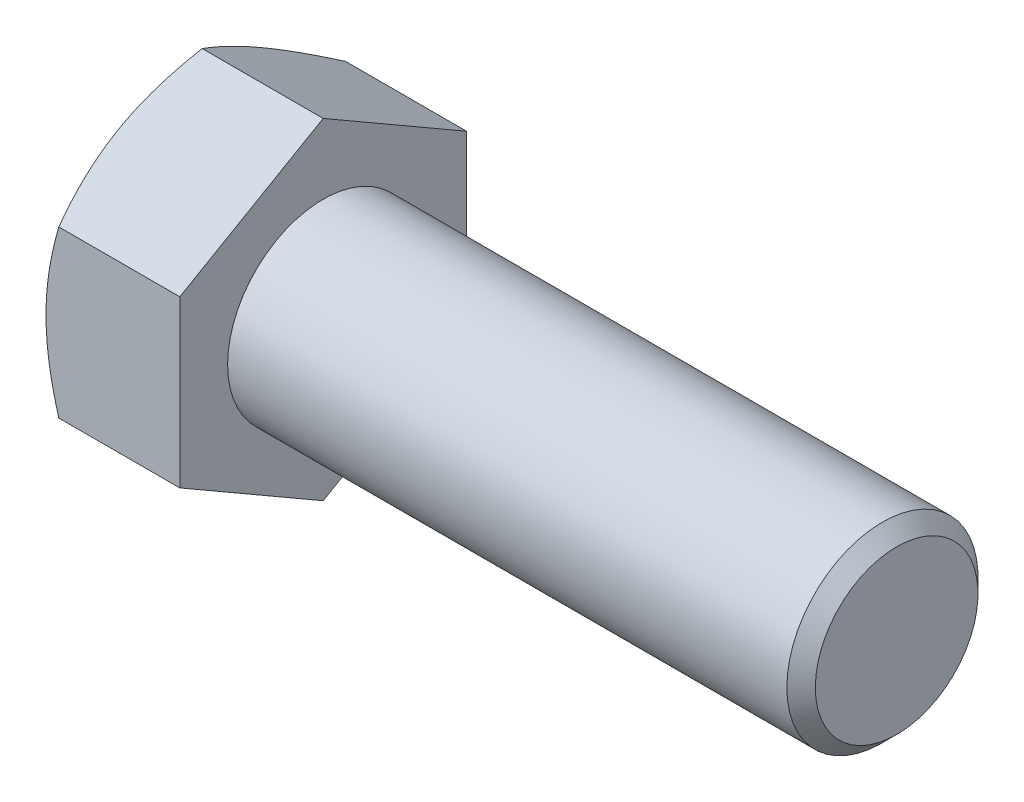
ISO-10303-21;
HEADER;
FILE_DESCRIPTION(('STEP AP214'),'2;1');
FILE_NAME('part.step','',(''),(''),'','','');
FILE_SCHEMA(('AUTOMOTIVE_DESIGN { 1 0 10303 214 1 1 1 1 }'));
ENDSEC;
DATA;
#1=APPLICATION_CONTEXT('core data for automotive mechanical design processes');
#2=APPLICATION_PROTOCOL_DEFINITION('international standard','automotive_design',2000,#1);
#3=PRODUCT_CONTEXT('',#1,'mechanical');
#4=PRODUCT('Part','Part','',(#3));
#5=PRODUCT_RELATED_PRODUCT_CATEGORY('part','',(#4));
#6=PRODUCT_DEFINITION_FORMATION('','',#4);
#7=PRODUCT_DEFINITION_CONTEXT('part definition',#1,'design');
#8=PRODUCT_DEFINITION('design','',#6,#7);
#9=PRODUCT_DEFINITION_SHAPE('','',#8);
#10=(LENGTH_UNIT() NAMED_UNIT(*) SI_UNIT(.MILLI.,.METRE.));
#11=(NAMED_UNIT(*) PLANE_ANGLE_UNIT() SI_UNIT($,.RADIAN.));
#12=(NAMED_UNIT(*) SI_UNIT($,.STERADIAN.) SOLID_ANGLE_UNIT());
#13=UNCERTAINTY_MEASURE_WITH_UNIT(LENGTH_MEASURE(1.E-05),#10,'distance_accuracy_value','');
#14=(GEOMETRIC_REPRESENTATION_CONTEXT(3) GLOBAL_UNCERTAINTY_ASSIGNED_CONTEXT((#13)) GLOBAL_UNIT_ASSIGNED_CONTEXT((#10,
#11,#12)) REPRESENTATION_CONTEXT('',''));
#15=CARTESIAN_POINT('',(0.,0.,0.));
#16=DIRECTION('',(0.,0.,1.));
#17=DIRECTION('',(1.,0.,0.));
#18=AXIS2_PLACEMENT_3D('',#15,#16,#17);
#19=CARTESIAN_POINT('',(17.78,10.9985226280624,-19.05));
#20=DIRECTION('',(0.,-0.866025403784438,0.500000000000001));
#21=DIRECTION('',(0.,-0.500000000000001,-0.866025403784438));
#22=AXIS2_PLACEMENT_3D('',#19,#20,#21);
#23=PLANE('',#22);
#24=CARTESIAN_POINT('',(1.70154403912923,21.9971607261786,0.0002));
#25=CARTESIAN_POINT('',(1.56198341710824,21.7554177843714,-0.418511057581224));
#26=CARTESIAN_POINT('',(1.42875584552933,21.5127319153775,-0.83885531295774));
#27=CARTESIAN_POINT('',(1.17672716507822,21.0254141255284,-1.68291448440842));
#28=CARTESIAN_POINT('',(1.05793080103128,20.7807815926483,-2.10663046054107));
#29=CARTESIAN_POINT('',(0.836361403470771,20.2890976796135,-2.95825197918165));
#30=CARTESIAN_POINT('',(0.733626282713296,20.0420419967675,-3.38616497416956));
#31=CARTESIAN_POINT('',(0.54638543408782,19.5462139577042,-4.24496432964444));
#32=CARTESIAN_POINT('',(0.461878662220423,19.2974417006436,-4.67585051838702));
#33=CARTESIAN_POINT('',(0.314688827717645,18.8045548928814,-5.5295555118115));
#34=CARTESIAN_POINT('',(0.251518592005308,18.5604769338332,-5.95231093789062));
#35=CARTESIAN_POINT('',(0.145596345015137,18.0712026189753,-6.79975891006299));
#36=CARTESIAN_POINT('',(0.102844726760497,17.8260062417296,-7.22445149328434));
#37=CARTESIAN_POINT('',(0.03883916789987,17.3352016053642,-8.07455006005964));
#38=CARTESIAN_POINT('',(0.0175596817216242,17.0895941847176,-8.49995459133542));
#39=CARTESIAN_POINT('',(-0.0030439848809676,16.5981526433441,-9.3511563099444));
#40=CARTESIAN_POINT('',(-0.00236884372942567,16.3523185298569,-9.77695348473787));
#41=CARTESIAN_POINT('',(0.0194033988503021,15.8927264269825,-10.5729903576738));
#42=CARTESIAN_POINT('',(0.0378455699352597,15.6789356908011,-10.9432867749275));
#43=CARTESIAN_POINT('',(0.0909844304102478,15.2518641922012,-11.6829963089671));
#44=CARTESIAN_POINT('',(0.125680887003941,15.0385834225228,-12.0524094383274));
#45=CARTESIAN_POINT('',(0.210726274890308,14.612612663106,-12.7902124361761));
#46=CARTESIAN_POINT('',(0.261089360566661,14.3999233837905,-13.1586010741756));
#47=CARTESIAN_POINT('',(0.376579300829333,13.9755573155247,-13.8936246654204));
#48=CARTESIAN_POINT('',(0.441706092858117,13.7638805222879,-14.2602596260897));
#49=CARTESIAN_POINT('',(0.66088839954324,13.121308345357,-15.3732272840641));
#50=CARTESIAN_POINT('',(0.836799169320431,12.6922737800414,-16.116336949394));
#51=CARTESIAN_POINT('',(1.23604434094317,11.840601970659,-17.5914757946184));
#52=CARTESIAN_POINT('',(1.4592849825153,11.4179538228748,-18.3235238603055));
#53=CARTESIAN_POINT('',(1.70154403912921,10.9984071580085,-19.0502));
#54=B_SPLINE_CURVE_WITH_KNOTS('',3,(#24,#25,#26,#27,#28,#29,#30,#31,#32,#33,#34,#35,#36,#37,#38,
#39,#40,#41,#42,#43,#44,#45,#46,#47,#48,#49,#50,#51,#52,#53),.UNSPECIFIED.,.F.,.F.,(4,2,2,2,2,2,
2,2,2,2,2,2,2,2,4),(0.,1.50971559281794,3.01992622800796,4.53364959201313,6.04728623691164,
7.52356313869613,8.99986845512143,10.4744153207586,11.9489166211861,13.2325441548787,
14.5161533048254,15.8009255464228,17.085692344219,19.7118183650732,22.3327898553892),.UNSPECIFIED.);
#55=CARTESIAN_POINT('',(1.70147737193763,21.9970452561248,0.));
#56=VERTEX_POINT('',#55);
#57=CARTESIAN_POINT('',(0.,16.4977839420935,-9.52500000000002));
#58=VERTEX_POINT('',#57);
#59=EDGE_CURVE('E48',#56,#58,#54,.T.);
#60=ORIENTED_EDGE('',*,*,#59,.F.);
#61=DIRECTION('',(-1.,0.,0.));
#62=VECTOR('',#61,1.);
#63=CARTESIAN_POINT('',(17.78,21.9970452561248,0.));
#64=LINE('',#63,#62);
#65=CARTESIAN_POINT('',(17.78,21.9970452561248,0.));
#66=VERTEX_POINT('',#65);
#67=EDGE_CURVE('E144',#66,#56,#64,.T.);
#68=ORIENTED_EDGE('',*,*,#67,.F.);
#69=DIRECTION('',(0.,0.500000000000001,0.866025403784438));
#70=VECTOR('',#69,1.);
#71=CARTESIAN_POINT('',(17.78,10.9985226280624,-19.05));
#72=LINE('',#71,#70);
#73=CARTESIAN_POINT('',(17.78,10.9985226280624,-19.05));
#74=VERTEX_POINT('',#73);
#75=EDGE_CURVE('E235',#74,#66,#72,.T.);
#76=ORIENTED_EDGE('',*,*,#75,.F.);
#77=DIRECTION('',(-1.,0.,0.));
#78=VECTOR('',#77,1.);
#79=CARTESIAN_POINT('',(17.78,10.9985226280624,-19.05));
#80=LINE('',#79,#78);
#81=CARTESIAN_POINT('',(1.70147737193761,10.9985226280624,-19.05));
#82=VERTEX_POINT('',#81);
#83=EDGE_CURVE('E132',#74,#82,#80,.T.);
#84=ORIENTED_EDGE('',*,*,#83,.T.);
#85=EDGE_CURVE('E126',#58,#82,#54,.T.);
#86=ORIENTED_EDGE('',*,*,#85,.F.);
#87=EDGE_LOOP('',(#60,#68,#76,#84,#86));
#88=FACE_BOUND('',#87,.T.);
#89=ADVANCED_FACE('F32',(#88),#23,.F.);
#90=CARTESIAN_POINT('',(17.78,21.9970452561248,0.));
#91=DIRECTION('',(0.,-0.866025403784438,-0.500000000000001));
#92=DIRECTION('',(0.,0.500000000000001,-0.866025403784438));
#93=AXIS2_PLACEMENT_3D('',#90,#91,#92);
#94=PLANE('',#93);
#95=CARTESIAN_POINT('',(1.70154403912922,10.9984071580085,19.0502));
#96=CARTESIAN_POINT('',(1.56198341710822,11.2401500998157,18.6314889424188));
#97=CARTESIAN_POINT('',(1.42875584552932,11.4828359688097,18.2111446870423));
#98=CARTESIAN_POINT('',(1.17672716507821,11.9701537586587,17.3670855155916));
#99=CARTESIAN_POINT('',(1.05793080103127,12.2147862915388,16.9433695394589));
#100=CARTESIAN_POINT('',(0.836361403470762,12.7064702045736,16.0917480208183));
#101=CARTESIAN_POINT('',(0.733626282713287,12.9535258874196,15.6638350258304));
#102=CARTESIAN_POINT('',(0.546385434087812,13.4493539264829,14.8050356703556));
#103=CARTESIAN_POINT('',(0.461878662220417,13.6981261835436,14.374149481613));
#104=CARTESIAN_POINT('',(0.314688827717642,14.1910129913057,13.5204444881885));
#105=CARTESIAN_POINT('',(0.251518592005306,14.4350909503539,13.0976890621094));
#106=CARTESIAN_POINT('',(0.145596345015136,14.9243652652118,12.250241089937));
#107=CARTESIAN_POINT('',(0.102844726760495,15.1695616424575,11.8255485067157));
#108=CARTESIAN_POINT('',(0.0388391678998689,15.6603662788229,10.9754499399404));
#109=CARTESIAN_POINT('',(0.0175596817216246,15.9059736994695,10.5500454086646));
#110=CARTESIAN_POINT('',(-0.00304398488096499,16.397415240843,9.69884369005561));
#111=CARTESIAN_POINT('',(-0.00236884372942224,16.6432493543302,9.27304651526214));
#112=CARTESIAN_POINT('',(0.0194033988503066,17.1028414572046,8.47700964232625));
#113=CARTESIAN_POINT('',(0.0378455699352645,17.316632193386,8.10671322507253));
#114=CARTESIAN_POINT('',(0.0909844304102546,17.7437036919859,7.36700369103291));
#115=CARTESIAN_POINT('',(0.125680887003949,17.9569844616643,6.99759056167259));
#116=CARTESIAN_POINT('',(0.210726274890318,18.3829552210812,6.25978756382388));
#117=CARTESIAN_POINT('',(0.26108936056667,18.5956445003966,5.89139892582437));
#118=CARTESIAN_POINT('',(0.376579300829342,19.0200105686625,5.15637533457961));
#119=CARTESIAN_POINT('',(0.441706092858128,19.2316873618992,4.7897403739103));
#120=CARTESIAN_POINT('',(0.660888399543252,19.8742595388301,3.67677271593589));
#121=CARTESIAN_POINT('',(0.836799169320443,20.3032941041457,2.93366305060603));
#122=CARTESIAN_POINT('',(1.23604434094318,21.1549659135281,1.45852420538159));
#123=CARTESIAN_POINT('',(1.45928498251531,21.5776140613123,0.726476139694543));
#124=CARTESIAN_POINT('',(1.70154403912923,21.9971607261786,-0.000199999999998885));
#125=B_SPLINE_CURVE_WITH_KNOTS('',3,(#95,#96,#97,#98,#99,#100,#101,#102,#103,#104,#105,#106,
#107,#108,#109,#110,#111,#112,#113,#114,#115,#116,#117,#118,#119,#120,#121,#122,#123,#124),
.UNSPECIFIED.,.F.,.F.,(4,2,2,2,2,2,2,2,2,2,2,2,2,2,4),(0.,1.50971559281794,3.01992622800796,
4.53364959201314,6.04728623691163,7.52356313869613,8.99986845512142,10.4744153207586,
11.9489166211861,13.2325441548787,14.5161533048254,15.8009255464228,17.085692344219,
19.7118183650731,22.3327898553892),.UNSPECIFIED.);
#126=CARTESIAN_POINT('',(1.70147737193762,10.9985226280624,19.05));
#127=VERTEX_POINT('',#126);
#128=CARTESIAN_POINT('',(0.,16.4977839420935,9.52500000000002));
#129=VERTEX_POINT('',#128);
#130=EDGE_CURVE('E55',#127,#129,#125,.T.);
#131=ORIENTED_EDGE('',*,*,#130,.F.);
#132=DIRECTION('',(-1.,0.,0.));
#133=VECTOR('',#132,1.);
#134=CARTESIAN_POINT('',(17.78,10.9985226280624,19.05));
#135=LINE('',#134,#133);
#136=CARTESIAN_POINT('',(17.78,10.9985226280624,19.05));
#137=VERTEX_POINT('',#136);
#138=EDGE_CURVE('E142',#137,#127,#135,.T.);
#139=ORIENTED_EDGE('',*,*,#138,.F.);
#140=DIRECTION('',(0.,-0.500000000000001,0.866025403784438));
#141=VECTOR('',#140,1.);
#142=CARTESIAN_POINT('',(17.78,21.9970452561248,0.));
#143=LINE('',#142,#141);
#144=EDGE_CURVE('E233',#66,#137,#143,.T.);
#145=ORIENTED_EDGE('',*,*,#144,.F.);
#146=ORIENTED_EDGE('',*,*,#67,.T.);
#147=EDGE_CURVE('E159',#129,#56,#125,.T.);
#148=ORIENTED_EDGE('',*,*,#147,.F.);
#149=EDGE_LOOP('',(#131,#139,#145,#146,#148));
#150=FACE_BOUND('',#149,.T.);
#151=ADVANCED_FACE('F165',(#150),#94,.F.);
#152=CARTESIAN_POINT('',(17.78,10.9985226280624,19.05));
#153=DIRECTION('',(0.,0.,-1.));
#154=DIRECTION('',(-1.,0.,0.));
#155=AXIS2_PLACEMENT_3D('',#152,#153,#154);
#156=PLANE('',#155);
#157=CARTESIAN_POINT('',(9.36387045247343,-29.681284606613,19.05));
#158=CARTESIAN_POINT('',(9.16146582961974,-29.264706606806,19.05));
#159=CARTESIAN_POINT('',(8.96006010911688,-28.8476434945091,19.05));
#160=CARTESIAN_POINT('',(8.55947242837995,-28.0124458613825,19.05));
#161=CARTESIAN_POINT('',(8.36029049009429,-27.5943113300281,19.05));
#162=CARTESIAN_POINT('',(7.7663676810725,-26.3380393948462,19.05));
#163=CARTESIAN_POINT('',(7.37530881268534,-25.498154743662,19.05));
#164=CARTESIAN_POINT('',(6.60327220097087,-23.808305939745,19.05));
#165=CARTESIAN_POINT('',(6.22235974347411,-22.9583118892264,19.05));
#166=CARTESIAN_POINT('',(5.47593301915302,-21.2516124787001,19.05));
#167=CARTESIAN_POINT('',(5.11041803414068,-20.3949074339305,19.05));
#168=CARTESIAN_POINT('',(4.38719116879672,-18.6452025304738,19.05));
#169=CARTESIAN_POINT('',(4.03012757182363,-17.7519333199389,19.05));
#170=CARTESIAN_POINT('',(3.34269044233918,-15.9549889007312,19.05));
#171=CARTESIAN_POINT('',(3.01231988615571,-15.0513125444405,19.05));
#172=CARTESIAN_POINT('',(2.38684616332965,-13.2337927829517,19.05));
#173=CARTESIAN_POINT('',(2.09167277054079,-12.3199737386897,19.05));
#174=CARTESIAN_POINT('',(1.54595671315604,-10.4791413209231,19.05));
#175=CARTESIAN_POINT('',(1.29540013570895,-9.55213215820611,19.05));
#176=CARTESIAN_POINT('',(0.962715893913424,-8.15413474991851,19.05));
#177=CARTESIAN_POINT('',(0.859241701469715,-7.68819648348643,19.05));
#178=CARTESIAN_POINT('',(0.667894608167373,-6.75311076402833,19.05));
#179=CARTESIAN_POINT('',(0.580021393447899,-6.28396337576073,19.05));
#180=CARTESIAN_POINT('',(0.421420281134063,-5.34278179688777,19.05));
#181=CARTESIAN_POINT('',(0.350691777614133,-4.87074770890834,19.05));
#182=CARTESIAN_POINT('',(0.227781142117217,-3.92425443579507,19.05));
#183=CARTESIAN_POINT('',(0.175598996477116,-3.44979525244806,19.05));
#184=CARTESIAN_POINT('',(0.091484358665081,-2.50539642167933,19.05));
#185=CARTESIAN_POINT('',(0.0592932834122934,-2.03547994750786,19.05));
#186=CARTESIAN_POINT('',(0.0148196511049127,-1.09470720819043,19.05));
#187=CARTESIAN_POINT('',(0.00253675993371639,-0.623850958949376,19.05));
#188=CARTESIAN_POINT('',(-0.00182781610310269,0.317959597669875,19.05));
#189=CARTESIAN_POINT('',(0.00609054987868912,0.788913905291908,19.05));
#190=CARTESIAN_POINT('',(0.0419336308306925,1.73006593492375,19.05));
#191=CARTESIAN_POINT('',(0.0698592408268269,2.20026362214292,19.05));
#192=CARTESIAN_POINT('',(0.160085140812835,3.32615149168687,19.05));
#193=CARTESIAN_POINT('',(0.231647760253748,3.9811127561872,19.05));
#194=CARTESIAN_POINT('',(0.409728300065855,5.2862687094639,19.05));
#195=CARTESIAN_POINT('',(0.516250858977386,5.93646275400804,19.05));
#196=CARTESIAN_POINT('',(0.760462128297077,7.23143263105088,19.05));
#197=CARTESIAN_POINT('',(0.898174747996119,7.87620391130365,19.05));
#198=CARTESIAN_POINT('',(1.20055584405695,9.159324879215,19.05));
#199=CARTESIAN_POINT('',(1.36522394390489,9.79767465643689,19.05));
#200=CARTESIAN_POINT('',(1.7214113056863,11.0820581020298,19.05));
#201=CARTESIAN_POINT('',(1.91344522350516,11.7279480495079,19.05));
#202=CARTESIAN_POINT('',(2.31762854711575,13.0133672560354,19.05));
#203=CARTESIAN_POINT('',(2.52977808690826,13.6528964726813,19.05));
#204=CARTESIAN_POINT('',(2.97080026317714,14.9259053212631,19.05));
#205=CARTESIAN_POINT('',(3.19966751894679,15.5593868261181,19.05));
#206=CARTESIAN_POINT('',(3.67140574966712,16.8210826190597,19.05));
#207=CARTESIAN_POINT('',(3.91427655235636,17.4492969718302,19.05));
#208=CARTESIAN_POINT('',(4.50783243685458,18.9429543286684,19.05));
#209=CARTESIAN_POINT('',(4.86391009787127,19.8062512923856,19.05));
#210=CARTESIAN_POINT('',(5.59369975040599,21.5253820385326,19.05));
#211=CARTESIAN_POINT('',(5.96741288850359,22.3812153314103,19.05));
#212=CARTESIAN_POINT('',(6.72890710622893,24.0868250540015,19.05));
#213=CARTESIAN_POINT('',(7.11669148004349,24.9366000089695,19.05));
#214=CARTESIAN_POINT('',(7.90345923334426,26.63091294583,19.05));
#215=CARTESIAN_POINT('',(8.3024423596857,27.4754510455742,19.05));
#216=CARTESIAN_POINT('',(9.10995217038491,29.161125765359,19.05));
#217=CARTESIAN_POINT('',(9.5184891939498,30.0022574236751,19.05));
#218=CARTESIAN_POINT('',(10.3430229269526,31.6808559628692,19.05));
#219=CARTESIAN_POINT('',(10.7590196703666,32.518322827034,19.05));
#220=CARTESIAN_POINT('',(11.5971269180795,34.1900490644371,19.05));
#221=CARTESIAN_POINT('',(12.0192366018988,35.0243088494536,19.05));
#222=CARTESIAN_POINT('',(12.8686125952728,36.6901944514231,19.05));
#223=CARTESIAN_POINT('',(13.2958788947363,37.5218202735267,19.05));
#224=CARTESIAN_POINT('',(14.510917657863,39.8716762337095,19.05));
#225=CARTESIAN_POINT('',(15.3037675196573,41.3872809173331,19.05));
#226=CARTESIAN_POINT('',(16.9002701357266,44.4128482567193,19.05));
#227=CARTESIAN_POINT('',(17.7039232916796,45.9228107000148,19.05));
#228=CARTESIAN_POINT('',(19.3174048995091,48.9344252680923,19.05));
#229=CARTESIAN_POINT('',(20.1272121106646,50.4360887804975,19.05));
#230=CARTESIAN_POINT('',(21.3467150335648,52.6859282817833,19.05));
#231=CARTESIAN_POINT('',(21.7540032158491,53.4354111964365,19.05));
#232=CARTESIAN_POINT('',(22.5700166567681,54.9335928565355,19.05));
#233=CARTESIAN_POINT('',(22.9787419131725,55.6822916031958,19.05));
#234=CARTESIAN_POINT('',(23.3881024870587,56.4306429205237,19.05));
#235=B_SPLINE_CURVE_WITH_KNOTS('',3,(#157,#158,#159,#160,#161,#162,#163,#164,#165,#166,#167,
#168,#169,#170,#171,#172,#173,#174,#175,#176,#177,#178,#179,#180,#181,#182,#183,#184,#185,#186,
#187,#188,#189,#190,#191,#192,#193,#194,#195,#196,#197,#198,#199,#200,#201,#202,#203,#204,#205,
#206,#207,#208,#209,#210,#211,#212,#213,#214,#215,#216,#217,#218,#219,#220,#221,#222,#223,#224,
#225,#226,#227,#228,#229,#230,#231,#232,#233,#234),.UNSPECIFIED.,.F.,.F.,(4,2,2,2,2,2,2,2,2,2,2,
2,2,2,2,2,2,2,2,2,2,2,2,2,2,2,2,2,2,2,2,2,2,2,2,2,2,2,4),(0.,1.38943761217531,2.77888892580274,
5.55819563283588,8.35240254614278,11.1464789839499,14.0321224955357,16.9180873194337,
19.7981940796754,22.6774011581476,24.1090510836395,25.5406722038995,26.9722427206616,
28.4038121827825,29.8164561105849,31.2290763299128,32.6417001048686,34.0543870776267,
36.0298747033623,38.0056245459738,39.9828940915955,41.9601360210948,43.9812438973033,
46.0023652381249,48.0228389099964,50.0432877327721,52.8445655115302,55.6460256683976,
58.4481459548751,61.2502029511148,64.0554471757798,66.8607041804397,69.665588089998,
72.4704665113671,77.6017760453958,82.7332768976462,87.8515588562165,90.4105564703669,
92.9695501149091),.UNSPECIFIED.);
#236=CARTESIAN_POINT('',(1.70147737193761,-10.9985226280623,19.05));
#237=VERTEX_POINT('',#236);
#238=CARTESIAN_POINT('',(0.,0.,19.05));
#239=VERTEX_POINT('',#238);
#240=EDGE_CURVE('E245',#237,#239,#235,.T.);
#241=ORIENTED_EDGE('',*,*,#240,.F.);
#242=DIRECTION('',(-1.,0.,0.));
#243=VECTOR('',#242,1.);
#244=CARTESIAN_POINT('',(17.78,-10.9985226280623,19.05));
#245=LINE('',#244,#243);
#246=CARTESIAN_POINT('',(17.78,-10.9985226280623,19.05));
#247=VERTEX_POINT('',#246);
#248=EDGE_CURVE('E134',#247,#237,#245,.T.);
#249=ORIENTED_EDGE('',*,*,#248,.F.);
#250=DIRECTION('',(0.,-1.,0.));
#251=VECTOR('',#250,1.);
#252=CARTESIAN_POINT('',(17.78,10.9985226280624,19.05));
#253=LINE('',#252,#251);
#254=EDGE_CURVE('E229',#137,#247,#253,.T.);
#255=ORIENTED_EDGE('',*,*,#254,.F.);
#256=ORIENTED_EDGE('',*,*,#138,.T.);
#257=EDGE_CURVE('E183',#239,#127,#235,.T.);
#258=ORIENTED_EDGE('',*,*,#257,.F.);
#259=EDGE_LOOP('',(#241,#249,#255,#256,#258));
#260=FACE_BOUND('',#259,.T.);
#261=ADVANCED_FACE('F251',(#260),#156,.F.);
#262=CARTESIAN_POINT('',(17.78,-21.9970452561248,0.));
#263=DIRECTION('',(0.,0.866025403784438,-0.500000000000002));
#264=DIRECTION('',(0.,0.500000000000002,0.866025403784438));
#265=AXIS2_PLACEMENT_3D('',#262,#263,#264);
#266=PLANE('',#265);
#267=CARTESIAN_POINT('',(1.70154403912923,-21.9971607261786,-0.000200000000000067));
#268=CARTESIAN_POINT('',(1.56198341710824,-21.7554177843714,0.418511057581222));
#269=CARTESIAN_POINT('',(1.42875584552933,-21.5127319153775,0.838855312957738));
#270=CARTESIAN_POINT('',(1.17672716507822,-21.0254141255284,1.68291448440842));
#271=CARTESIAN_POINT('',(1.05793080103128,-20.7807815926483,2.10663046054107));
#272=CARTESIAN_POINT('',(0.836361403470769,-20.2890976796135,2.95825197918165));
#273=CARTESIAN_POINT('',(0.733626282713293,-20.0420419967675,3.38616497416956));
#274=CARTESIAN_POINT('',(0.546385434087817,-19.5462139577042,4.24496432964444));
#275=CARTESIAN_POINT('',(0.461878662220421,-19.2974417006435,4.67585051838702));
#276=CARTESIAN_POINT('',(0.314688827717642,-18.8045548928814,5.5295555118115));
#277=CARTESIAN_POINT('',(0.251518592005304,-18.5604769338332,5.95231093789062));
#278=CARTESIAN_POINT('',(0.145596345015132,-18.0712026189753,6.79975891006298));
#279=CARTESIAN_POINT('',(0.102844726760491,-17.8260062417296,7.22445149328434));
#280=CARTESIAN_POINT('',(0.0388391678998642,-17.3352016053642,8.07455006005963));
#281=CARTESIAN_POINT('',(0.0175596817216182,-17.0895941847176,8.49995459133541));
#282=CARTESIAN_POINT('',(-0.00304398488097359,-16.5981526433441,9.35115630994439));
#283=CARTESIAN_POINT('',(-0.00236884372943127,-16.3523185298569,9.77695348473786));
#284=CARTESIAN_POINT('',(0.0194033988502967,-15.8927264269825,10.5729903576737));
#285=CARTESIAN_POINT('',(0.0378455699352542,-15.6789356908011,10.9432867749275));
#286=CARTESIAN_POINT('',(0.0909844304102423,-15.2518641922012,11.6829963089671));
#287=CARTESIAN_POINT('',(0.125680887003936,-15.0385834225228,12.0524094383274));
#288=CARTESIAN_POINT('',(0.210726274890302,-14.6126126631059,12.7902124361761));
#289=CARTESIAN_POINT('',(0.261089360566655,-14.3999233837905,13.1586010741756));
#290=CARTESIAN_POINT('',(0.376579300829327,-13.9755573155246,13.8936246654204));
#291=CARTESIAN_POINT('',(0.441706092858111,-13.7638805222879,14.2602596260897));
#292=CARTESIAN_POINT('',(0.660888399543233,-13.121308345357,15.3732272840641));
#293=CARTESIAN_POINT('',(0.836799169320424,-12.6922737800414,16.116336949394));
#294=CARTESIAN_POINT('',(1.23604434094316,-11.840601970659,17.5914757946184));
#295=CARTESIAN_POINT('',(1.45928498251529,-11.4179538228748,18.3235238603055));
#296=CARTESIAN_POINT('',(1.70154403912921,-10.9984071580085,19.0502));
#297=B_SPLINE_CURVE_WITH_KNOTS('',3,(#267,#268,#269,#270,#271,#272,#273,#274,#275,#276,#277,
#278,#279,#280,#281,#282,#283,#284,#285,#286,#287,#288,#289,#290,#291,#292,#293,#294,#295,#296),
.UNSPECIFIED.,.F.,.F.,(4,2,2,2,2,2,2,2,2,2,2,2,2,2,4),(0.,1.50971559281794,3.01992622800796,
4.53364959201314,6.04728623691164,7.52356313869613,8.99986845512143,10.4744153207586,
11.9489166211861,13.2325441548787,14.5161533048254,15.8009255464228,17.085692344219,
19.7118183650732,22.3327898553893),.UNSPECIFIED.);
#298=CARTESIAN_POINT('',(1.70147737193763,-21.9970452561248,0.));
#299=VERTEX_POINT('',#298);
#300=CARTESIAN_POINT('',(0.,-16.4977839420935,9.52500000000004));
#301=VERTEX_POINT('',#300);
#302=EDGE_CURVE('E167',#299,#301,#297,.T.);
#303=ORIENTED_EDGE('',*,*,#302,.F.);
#304=DIRECTION('',(-1.,0.,0.));
#305=VECTOR('',#304,1.);
#306=CARTESIAN_POINT('',(17.78,-21.9970452561248,0.));
#307=LINE('',#306,#305);
#308=CARTESIAN_POINT('',(17.78,-21.9970452561248,0.));
#309=VERTEX_POINT('',#308);
#310=EDGE_CURVE('E131',#309,#299,#307,.T.);
#311=ORIENTED_EDGE('',*,*,#310,.F.);
#312=DIRECTION('',(0.,-0.500000000000002,-0.866025403784438));
#313=VECTOR('',#312,1.);
#314=CARTESIAN_POINT('',(17.78,-21.9970452561248,0.));
#315=LINE('',#314,#313);
#316=EDGE_CURVE('E227',#247,#309,#315,.T.);
#317=ORIENTED_EDGE('',*,*,#316,.F.);
#318=ORIENTED_EDGE('',*,*,#248,.T.);
#319=EDGE_CURVE('E169',#301,#237,#297,.T.);
#320=ORIENTED_EDGE('',*,*,#319,.F.);
#321=EDGE_LOOP('',(#303,#311,#317,#318,#320));
#322=FACE_BOUND('',#321,.T.);
#323=ADVANCED_FACE('F223',(#322),#266,.F.);
#324=CARTESIAN_POINT('',(17.78,-10.9985226280624,-19.05));
#325=DIRECTION('',(0.,0.866025403784439,0.5));
#326=DIRECTION('',(0.,-0.5,0.866025403784439));
#327=AXIS2_PLACEMENT_3D('',#324,#325,#326);
#328=PLANE('',#327);
#329=CARTESIAN_POINT('',(1.70154403912922,-10.9984071580086,-19.0502));
#330=CARTESIAN_POINT('',(1.56198341710823,-11.2401500998157,-18.6314889424188));
#331=CARTESIAN_POINT('',(1.42875584552933,-11.4828359688097,-18.2111446870423));
#332=CARTESIAN_POINT('',(1.17672716507822,-11.9701537586587,-17.3670855155916));
#333=CARTESIAN_POINT('',(1.05793080103128,-12.2147862915388,-16.9433695394589));
#334=CARTESIAN_POINT('',(0.836361403470767,-12.7064702045737,-16.0917480208183));
#335=CARTESIAN_POINT('',(0.733626282713293,-12.9535258874197,-15.6638350258304));
#336=CARTESIAN_POINT('',(0.546385434087819,-13.449353926483,-14.8050356703556));
#337=CARTESIAN_POINT('',(0.461878662220424,-13.6981261835436,-14.374149481613));
#338=CARTESIAN_POINT('',(0.314688827717648,-14.1910129913057,-13.5204444881885));
#339=CARTESIAN_POINT('',(0.25151859200531,-14.4350909503539,-13.0976890621094));
#340=CARTESIAN_POINT('',(0.145596345015141,-14.9243652652118,-12.250241089937));
#341=CARTESIAN_POINT('',(0.102844726760501,-15.1695616424575,-11.8255485067157));
#342=CARTESIAN_POINT('',(0.0388391678998762,-15.6603662788229,-10.9754499399404));
#343=CARTESIAN_POINT('',(0.0175596817216313,-15.9059736994695,-10.5500454086646));
#344=CARTESIAN_POINT('',(-0.00304398488095875,-16.3974152408431,-9.6988436900556));
#345=CARTESIAN_POINT('',(-0.002368843729416,-16.6432493543302,-9.27304651526213));
#346=CARTESIAN_POINT('',(0.0194033988503124,-17.1028414572047,-8.47700964232624));
#347=CARTESIAN_POINT('',(0.0378455699352699,-17.316632193386,-8.10671322507252));
#348=CARTESIAN_POINT('',(0.0909844304102587,-17.7437036919859,-7.3670036910329));
#349=CARTESIAN_POINT('',(0.125680887003953,-17.9569844616643,-6.99759056167259));
#350=CARTESIAN_POINT('',(0.21072627489032,-18.3829552210812,-6.25978756382388));
#351=CARTESIAN_POINT('',(0.261089360566673,-18.5956445003966,-5.89139892582437));
#352=CARTESIAN_POINT('',(0.376579300829346,-19.0200105686625,-5.15637533457961));
#353=CARTESIAN_POINT('',(0.441706092858132,-19.2316873618992,-4.78974037391031));
#354=CARTESIAN_POINT('',(0.660888399543257,-19.8742595388301,-3.6767727159359));
#355=CARTESIAN_POINT('',(0.836799169320446,-20.3032941041457,-2.93366305060604));
#356=CARTESIAN_POINT('',(1.23604434094318,-21.1549659135281,-1.45852420538159));
#357=CARTESIAN_POINT('',(1.45928498251531,-21.5776140613123,-0.726476139694544));
#358=CARTESIAN_POINT('',(1.70154403912923,-21.9971607261786,0.000199999999997129));
#359=B_SPLINE_CURVE_WITH_KNOTS('',3,(#329,#330,#331,#332,#333,#334,#335,#336,#337,#338,#339,
#340,#341,#342,#343,#344,#345,#346,#347,#348,#349,#350,#351,#352,#353,#354,#355,#356,#357,#358),
.UNSPECIFIED.,.F.,.F.,(4,2,2,2,2,2,2,2,2,2,2,2,2,2,4),(0.,1.50971559281794,3.01992622800796,
4.53364959201314,6.04728623691163,7.52356313869613,8.99986845512142,10.4744153207586,
11.9489166211861,13.2325441548787,14.5161533048254,15.8009255464228,17.085692344219,
19.7118183650731,22.3327898553892),.UNSPECIFIED.);
#360=CARTESIAN_POINT('',(1.70147737193762,-10.9985226280624,-19.05));
#361=VERTEX_POINT('',#360);
#362=CARTESIAN_POINT('',(0.,-16.4977839420936,-9.525));
#363=VERTEX_POINT('',#362);
#364=EDGE_CURVE('E108',#361,#363,#359,.T.);
#365=ORIENTED_EDGE('',*,*,#364,.F.);
#366=DIRECTION('',(-1.,0.,0.));
#367=VECTOR('',#366,1.);
#368=CARTESIAN_POINT('',(17.78,-10.9985226280624,-19.05));
#369=LINE('',#368,#367);
#370=CARTESIAN_POINT('',(17.78,-10.9985226280624,-19.05));
#371=VERTEX_POINT('',#370);
#372=EDGE_CURVE('E122',#371,#361,#369,.T.);
#373=ORIENTED_EDGE('',*,*,#372,.F.);
#374=DIRECTION('',(0.,0.5,-0.866025403784439));
#375=VECTOR('',#374,1.);
#376=CARTESIAN_POINT('',(17.78,-10.9985226280624,-19.05));
#377=LINE('',#376,#375);
#378=EDGE_CURVE('E225',#309,#371,#377,.T.);
#379=ORIENTED_EDGE('',*,*,#378,.F.);
#380=ORIENTED_EDGE('',*,*,#310,.T.);
#381=EDGE_CURVE('E125',#363,#299,#359,.T.);
#382=ORIENTED_EDGE('',*,*,#381,.F.);
#383=EDGE_LOOP('',(#365,#373,#379,#380,#382));
#384=FACE_BOUND('',#383,.T.);
#385=ADVANCED_FACE('F120',(#384),#328,.F.);
#386=CARTESIAN_POINT('',(17.78,10.9985226280624,-19.05));
#387=DIRECTION('',(0.,0.,1.));
#388=DIRECTION('',(1.,0.,0.));
#389=AXIS2_PLACEMENT_3D('',#386,#387,#388);
#390=PLANE('',#389);
#391=CARTESIAN_POINT('',(9.36387045247347,-29.6812846066131,-19.05));
#392=CARTESIAN_POINT('',(9.16146582961978,-29.264706606806,-19.05));
#393=CARTESIAN_POINT('',(8.96006010911692,-28.8476434945092,-19.05));
#394=CARTESIAN_POINT('',(8.55947242837999,-28.0124458613826,-19.05));
#395=CARTESIAN_POINT('',(8.36029049009433,-27.5943113300282,-19.05));
#396=CARTESIAN_POINT('',(7.76636768107253,-26.3380393948462,-19.05));
#397=CARTESIAN_POINT('',(7.37530881268537,-25.498154743662,-19.05));
#398=CARTESIAN_POINT('',(6.6032722009709,-23.8083059397451,-19.05));
#399=CARTESIAN_POINT('',(6.22235974347414,-22.9583118892265,-19.05));
#400=CARTESIAN_POINT('',(5.47593301915305,-21.2516124787002,-19.05));
#401=CARTESIAN_POINT('',(5.11041803414071,-20.3949074339305,-19.05));
#402=CARTESIAN_POINT('',(4.38719116879675,-18.6452025304738,-19.05));
#403=CARTESIAN_POINT('',(4.03012757182365,-17.751933319939,-19.05));
#404=CARTESIAN_POINT('',(3.3426904423392,-15.9549889007313,-19.05));
#405=CARTESIAN_POINT('',(3.01231988615573,-15.0513125444405,-19.05));
#406=CARTESIAN_POINT('',(2.38684616332967,-13.2337927829517,-19.05));
#407=CARTESIAN_POINT('',(2.09167277054081,-12.3199737386898,-19.05));
#408=CARTESIAN_POINT('',(1.54595671315605,-10.4791413209232,-19.05));
#409=CARTESIAN_POINT('',(1.29540013570896,-9.55213215820616,-19.05));
#410=CARTESIAN_POINT('',(0.962715893913434,-8.15413474991856,-19.05));
#411=CARTESIAN_POINT('',(0.859241701469725,-7.68819648348648,-19.05));
#412=CARTESIAN_POINT('',(0.667894608167383,-6.75311076402837,-19.05));
#413=CARTESIAN_POINT('',(0.580021393447906,-6.28396337576078,-19.05));
#414=CARTESIAN_POINT('',(0.421420281134069,-5.34278179688781,-19.05));
#415=CARTESIAN_POINT('',(0.350691777614139,-4.87074770890838,-19.05));
#416=CARTESIAN_POINT('',(0.227781142117224,-3.92425443579511,-19.05));
#417=CARTESIAN_POINT('',(0.175598996477123,-3.44979525244811,-19.05));
#418=CARTESIAN_POINT('',(0.0914843586650862,-2.50539642167937,-19.05));
#419=CARTESIAN_POINT('',(0.0592932834122966,-2.0354799475079,-19.05));
#420=CARTESIAN_POINT('',(0.0148196511049135,-1.09470720819047,-19.05));
#421=CARTESIAN_POINT('',(0.00253675993371704,-0.623850958949416,-19.05));
#422=CARTESIAN_POINT('',(-0.00182781610310333,0.317959597669835,-19.05));
#423=CARTESIAN_POINT('',(0.00609054987868741,0.788913905291869,-19.05));
#424=CARTESIAN_POINT('',(0.0419336308306902,1.73006593492372,-19.05));
#425=CARTESIAN_POINT('',(0.0698592408268251,2.20026362214288,-19.05));
#426=CARTESIAN_POINT('',(0.160085140812833,3.32615149168683,-19.05));
#427=CARTESIAN_POINT('',(0.231647760253744,3.98111275618715,-19.05));
#428=CARTESIAN_POINT('',(0.409728300065848,5.28626870946385,-19.05));
#429=CARTESIAN_POINT('',(0.516250858977377,5.93646275400799,-19.05));
#430=CARTESIAN_POINT('',(0.760462128297066,7.23143263105083,-19.05));
#431=CARTESIAN_POINT('',(0.898174747996107,7.87620391130359,-19.05));
#432=CARTESIAN_POINT('',(1.20055584405693,9.15932487921494,-19.05));
#433=CARTESIAN_POINT('',(1.36522394390487,9.79767465643683,-19.05));
#434=CARTESIAN_POINT('',(1.72141130568628,11.0820581020297,-19.05));
#435=CARTESIAN_POINT('',(1.91344522350514,11.7279480495078,-19.05));
#436=CARTESIAN_POINT('',(2.31762854711573,13.0133672560353,-19.05));
#437=CARTESIAN_POINT('',(2.52977808690824,13.6528964726812,-19.05));
#438=CARTESIAN_POINT('',(2.97080026317712,14.9259053212631,-19.05));
#439=CARTESIAN_POINT('',(3.19966751894677,15.5593868261181,-19.05));
#440=CARTESIAN_POINT('',(3.6714057496671,16.8210826190597,-19.05));
#441=CARTESIAN_POINT('',(3.91427655235634,17.4492969718301,-19.05));
#442=CARTESIAN_POINT('',(4.50783243685455,18.9429543286683,-19.05));
#443=CARTESIAN_POINT('',(4.86391009787124,19.8062512923856,-19.05));
#444=CARTESIAN_POINT('',(5.59369975040596,21.5253820385326,-19.05));
#445=CARTESIAN_POINT('',(5.96741288850356,22.3812153314102,-19.05));
#446=CARTESIAN_POINT('',(6.7289071062289,24.0868250540014,-19.05));
#447=CARTESIAN_POINT('',(7.11669148004346,24.9366000089695,-19.05));
#448=CARTESIAN_POINT('',(7.90345923334423,26.63091294583,-19.05));
#449=CARTESIAN_POINT('',(8.30244235968568,27.4754510455741,-19.05));
#450=CARTESIAN_POINT('',(9.10995217038488,29.161125765359,-19.05));
#451=CARTESIAN_POINT('',(9.51848919394977,30.0022574236751,-19.05));
#452=CARTESIAN_POINT('',(10.3430229269526,31.6808559628692,-19.05));
#453=CARTESIAN_POINT('',(10.7590196703666,32.5183228270339,-19.05));
#454=CARTESIAN_POINT('',(11.5971269180795,34.1900490644371,-19.05));
#455=CARTESIAN_POINT('',(12.0192366018987,35.0243088494535,-19.05));
#456=CARTESIAN_POINT('',(12.8686125952728,36.690194451423,-19.05));
#457=CARTESIAN_POINT('',(13.2958788947363,37.5218202735267,-19.05));
#458=CARTESIAN_POINT('',(14.510917657863,39.8716762337095,-19.05));
#459=CARTESIAN_POINT('',(15.3037675196573,41.3872809173331,-19.05));
#460=CARTESIAN_POINT('',(16.9002701357265,44.4128482567192,-19.05));
#461=CARTESIAN_POINT('',(17.7039232916796,45.9228107000148,-19.05));
#462=CARTESIAN_POINT('',(19.3174048995091,48.9344252680923,-19.05));
#463=CARTESIAN_POINT('',(20.1272121106646,50.4360887804975,-19.05));
#464=CARTESIAN_POINT('',(21.3467150335648,52.6859282817833,-19.05));
#465=CARTESIAN_POINT('',(21.7540032158491,53.4354111964365,-19.05));
#466=CARTESIAN_POINT('',(22.5700166567681,54.9335928565355,-19.05));
#467=CARTESIAN_POINT('',(22.9787419131725,55.6822916031958,-19.05));
#468=CARTESIAN_POINT('',(23.3881024870587,56.4306429205237,-19.05));
#469=B_SPLINE_CURVE_WITH_KNOTS('',3,(#391,#392,#393,#394,#395,#396,#397,#398,#399,#400,#401,
#402,#403,#404,#405,#406,#407,#408,#409,#410,#411,#412,#413,#414,#415,#416,#417,#418,#419,#420,
#421,#422,#423,#424,#425,#426,#427,#428,#429,#430,#431,#432,#433,#434,#435,#436,#437,#438,#439,
#440,#441,#442,#443,#444,#445,#446,#447,#448,#449,#450,#451,#452,#453,#454,#455,#456,#457,#458,
#459,#460,#461,#462,#463,#464,#465,#466,#467,#468),.UNSPECIFIED.,.F.,.F.,(4,2,2,2,2,2,2,2,2,2,2,
2,2,2,2,2,2,2,2,2,2,2,2,2,2,2,2,2,2,2,2,2,2,2,2,2,2,2,4),(0.,1.38943761217531,2.77888892580273,
5.55819563283589,8.35240254614279,11.1464789839499,14.0321224955357,16.9180873194338,
19.7981940796754,22.6774011581476,24.1090510836395,25.5406722038995,26.9722427206616,
28.4038121827825,29.816456110585,31.2290763299128,32.6417001048687,34.0543870776267,
36.0298747033624,38.0056245459739,39.9828940915956,41.9601360210948,43.9812438973033,
46.0023652381249,48.0228389099964,50.0432877327721,52.8445655115302,55.6460256683976,
58.4481459548751,61.2502029511148,64.0554471757798,66.8607041804397,69.6655880899981,
72.4704665113671,77.6017760453958,82.7332768976462,87.8515588562166,90.410556470367,
92.9695501149091),.UNSPECIFIED.);
#470=CARTESIAN_POINT('',(0.,0.,-19.05));
#471=VERTEX_POINT('',#470);
#472=EDGE_CURVE('E114',#82,#471,#469,.F.);
#473=ORIENTED_EDGE('',*,*,#472,.F.);
#474=ORIENTED_EDGE('',*,*,#83,.F.);
#475=DIRECTION('',(0.,1.,0.));
#476=VECTOR('',#475,1.);
#477=CARTESIAN_POINT('',(17.78,10.9985226280624,-19.05));
#478=LINE('',#477,#476);
#479=EDGE_CURVE('E130',#371,#74,#478,.T.);
#480=ORIENTED_EDGE('',*,*,#479,.F.);
#481=ORIENTED_EDGE('',*,*,#372,.T.);
#482=EDGE_CURVE('E105',#471,#361,#469,.F.);
#483=ORIENTED_EDGE('',*,*,#482,.F.);
#484=EDGE_LOOP('',(#473,#474,#480,#481,#483));
#485=FACE_BOUND('',#484,.T.);
#486=ADVANCED_FACE('F128',(#485),#390,.F.);
#487=CARTESIAN_POINT('',(17.78,21.9970452561248,0.));
#488=DIRECTION('',(1.,0.,0.));
#489=DIRECTION('',(0.,0.,-1.));
#490=AXIS2_PLACEMENT_3D('',#487,#488,#489);
#491=PLANE('',#490);
#492=CARTESIAN_POINT('',(17.78,0.,0.));
#493=DIRECTION('',(1.,0.,0.));
#494=DIRECTION('',(0.,0.,-1.));
#495=AXIS2_PLACEMENT_3D('',#492,#493,#494);
#496=CIRCLE('',#495,12.7);
#497=CARTESIAN_POINT('',(17.78,0.,-12.7));
#498=VERTEX_POINT('',#497);
#499=EDGE_CURVE('E238',#498,#498,#496,.F.);
#500=ORIENTED_EDGE('',*,*,#499,.T.);
#501=EDGE_LOOP('',(#500));
#502=FACE_BOUND('',#501,.T.);
#503=ORIENTED_EDGE('',*,*,#75,.T.);
#504=ORIENTED_EDGE('',*,*,#144,.T.);
#505=ORIENTED_EDGE('',*,*,#254,.T.);
#506=ORIENTED_EDGE('',*,*,#316,.T.);
#507=ORIENTED_EDGE('',*,*,#378,.T.);
#508=ORIENTED_EDGE('',*,*,#479,.T.);
#509=EDGE_LOOP('',(#503,#504,#505,#506,#507,#508));
#510=FACE_BOUND('',#509,.T.);
#511=ADVANCED_FACE('F253',(#502,#510),#491,.T.);
#512=CARTESIAN_POINT('',(0.,0.,0.));
#513=DIRECTION('',(-1.,0.,0.));
#514=DIRECTION('',(0.,0.,1.));
#515=AXIS2_PLACEMENT_3D('',#512,#513,#514);
#516=CYLINDRICAL_SURFACE('',#515,12.7);
#517=ORIENTED_EDGE('',*,*,#499,.F.);
#518=EDGE_LOOP('',(#517));
#519=FACE_BOUND('',#518,.T.);
#520=CARTESIAN_POINT('',(92.0877,0.,0.));
#521=DIRECTION('',(-1.,0.,0.));
#522=DIRECTION('',(0.,0.,1.));
#523=AXIS2_PLACEMENT_3D('',#520,#521,#522);
#524=CIRCLE('',#523,12.7);
#525=CARTESIAN_POINT('',(92.0877,0.,12.7));
#526=VERTEX_POINT('',#525);
#527=EDGE_CURVE('E241',#526,#526,#524,.T.);
#528=ORIENTED_EDGE('',*,*,#527,.T.);
#529=EDGE_LOOP('',(#528));
#530=FACE_BOUND('',#529,.T.);
#531=ADVANCED_FACE('F284',(#519,#530),#516,.T.);
#532=CARTESIAN_POINT('',(93.98,0.,0.));
#533=DIRECTION('',(-1.,0.,0.));
#534=DIRECTION('',(0.,0.,1.));
#535=AXIS2_PLACEMENT_3D('',#532,#533,#534);
#536=CONICAL_SURFACE('',#535,10.8077,0.785398163397437);
#537=ORIENTED_EDGE('',*,*,#527,.F.);
#538=EDGE_LOOP('',(#537));
#539=FACE_BOUND('',#538,.T.);
#540=CARTESIAN_POINT('',(93.98,0.,0.));
#541=DIRECTION('',(-1.,0.,0.));
#542=DIRECTION('',(0.,0.,1.));
#543=AXIS2_PLACEMENT_3D('',#540,#541,#542);
#544=CIRCLE('',#543,10.8077);
#545=CARTESIAN_POINT('',(93.98,0.,10.8077));
#546=VERTEX_POINT('',#545);
#547=EDGE_CURVE('E243',#546,#546,#544,.T.);
#548=ORIENTED_EDGE('',*,*,#547,.T.);
#549=EDGE_LOOP('',(#548));
#550=FACE_BOUND('',#549,.T.);
#551=ADVANCED_FACE('F287',(#539,#550),#536,.T.);
#552=CARTESIAN_POINT('',(93.98,0.,0.));
#553=DIRECTION('',(-1.,0.,0.));
#554=DIRECTION('',(0.,0.,1.));
#555=AXIS2_PLACEMENT_3D('',#552,#553,#554);
#556=PLANE('',#555);
#557=ORIENTED_EDGE('',*,*,#547,.F.);
#558=EDGE_LOOP('',(#557));
#559=FACE_BOUND('',#558,.T.);
#560=ADVANCED_FACE('F197',(#559),#556,.F.);
#561=CARTESIAN_POINT('',(0.,0.,0.));
#562=DIRECTION('',(1.,0.,0.));
#563=DIRECTION('',(0.,0.,-1.));
#564=AXIS2_PLACEMENT_3D('',#561,#562,#563);
#565=CONICAL_SURFACE('',#564,19.05,1.0471975511966);
#566=ORIENTED_EDGE('',*,*,#364,.T.);
#567=CARTESIAN_POINT('',(0.,0.,0.));
#568=DIRECTION('',(1.,0.,0.));
#569=DIRECTION('',(0.,0.,-1.));
#570=AXIS2_PLACEMENT_3D('',#567,#568,#569);
#571=CIRCLE('',#570,19.05);
#572=EDGE_CURVE('E36',#363,#471,#571,.T.);
#573=ORIENTED_EDGE('',*,*,#572,.T.);
#574=ORIENTED_EDGE('',*,*,#482,.T.);
#575=EDGE_LOOP('',(#566,#573,#574));
#576=FACE_BOUND('',#575,.T.);
#577=ADVANCED_FACE('F107',(#576),#565,.T.);
#578=ORIENTED_EDGE('',*,*,#302,.T.);
#579=EDGE_CURVE('E149',#301,#363,#571,.T.);
#580=ORIENTED_EDGE('',*,*,#579,.T.);
#581=ORIENTED_EDGE('',*,*,#381,.T.);
#582=EDGE_LOOP('',(#578,#580,#581));
#583=FACE_BOUND('',#582,.T.);
#584=ADVANCED_FACE('F196',(#583),#565,.T.);
#585=ORIENTED_EDGE('',*,*,#240,.T.);
#586=EDGE_CURVE('E150',#239,#301,#571,.T.);
#587=ORIENTED_EDGE('',*,*,#586,.T.);
#588=ORIENTED_EDGE('',*,*,#319,.T.);
#589=EDGE_LOOP('',(#585,#587,#588));
#590=FACE_BOUND('',#589,.T.);
#591=ADVANCED_FACE('F191',(#590),#565,.T.);
#592=ORIENTED_EDGE('',*,*,#257,.T.);
#593=ORIENTED_EDGE('',*,*,#130,.T.);
#594=CARTESIAN_POINT('',(0.,0.,0.));
#595=DIRECTION('',(-1.,0.,0.));
#596=DIRECTION('',(0.,0.,1.));
#597=AXIS2_PLACEMENT_3D('',#594,#595,#596);
#598=CIRCLE('',#597,19.05);
#599=EDGE_CURVE('E115',#239,#129,#598,.T.);
#600=ORIENTED_EDGE('',*,*,#599,.F.);
#601=EDGE_LOOP('',(#592,#593,#600));
#602=FACE_BOUND('',#601,.T.);
#603=ADVANCED_FACE('F195',(#602),#565,.T.);
#604=ORIENTED_EDGE('',*,*,#147,.T.);
#605=ORIENTED_EDGE('',*,*,#59,.T.);
#606=EDGE_CURVE('E41',#58,#129,#571,.T.);
#607=ORIENTED_EDGE('',*,*,#606,.T.);
#608=EDGE_LOOP('',(#604,#605,#607));
#609=FACE_BOUND('',#608,.T.);
#610=ADVANCED_FACE('F158',(#609),#565,.T.);
#611=ORIENTED_EDGE('',*,*,#85,.T.);
#612=ORIENTED_EDGE('',*,*,#472,.T.);
#613=EDGE_CURVE('E11',#471,#58,#571,.T.);
#614=ORIENTED_EDGE('',*,*,#613,.T.);
#615=EDGE_LOOP('',(#611,#612,#614));
#616=FACE_BOUND('',#615,.T.);
#617=ADVANCED_FACE('F256',(#616),#565,.T.);
#618=CARTESIAN_POINT('',(0.,21.9970452561248,0.));
#619=DIRECTION('',(1.,0.,0.));
#620=DIRECTION('',(0.,0.,-1.));
#621=AXIS2_PLACEMENT_3D('',#618,#619,#620);
#622=PLANE('',#621);
#623=ORIENTED_EDGE('',*,*,#613,.F.);
#624=ORIENTED_EDGE('',*,*,#572,.F.);
#625=ORIENTED_EDGE('',*,*,#579,.F.);
#626=ORIENTED_EDGE('',*,*,#586,.F.);
#627=ORIENTED_EDGE('',*,*,#599,.T.);
#628=ORIENTED_EDGE('',*,*,#606,.F.);
#629=EDGE_LOOP('',(#623,#624,#625,#626,#627,#628));
#630=FACE_BOUND('',#629,.T.);
#631=ADVANCED_FACE('F162',(#630),#622,.F.);
#632=CLOSED_SHELL('',(#89,#151,#261,#323,#385,#486,#511,#531,#551,#560,#577,#584,#591,#603,#610,
#617,#631));
#633=MANIFOLD_SOLID_BREP('B2',#632);
#634=ADVANCED_BREP_SHAPE_REPRESENTATION('',(#18,#633),#14);
#635=SHAPE_DEFINITION_REPRESENTATION(#9,#634);
ENDSEC;
END-ISO-10303-21;
